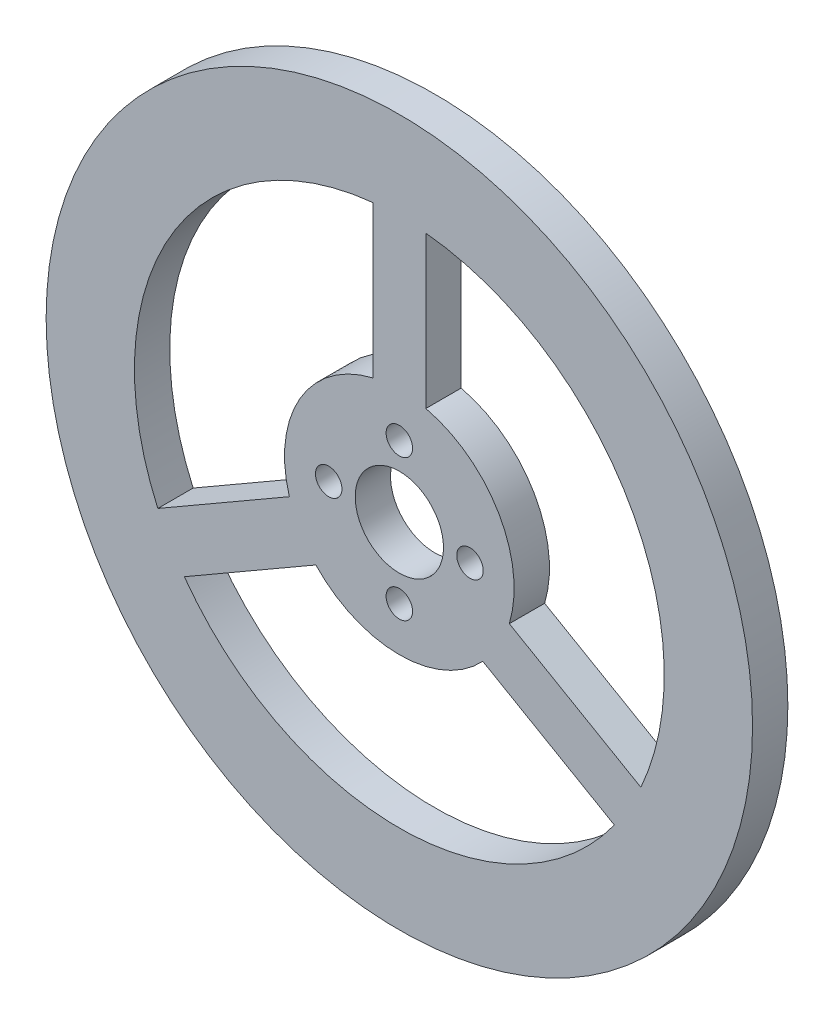
ISO-10303-21;
HEADER;
FILE_DESCRIPTION(('STEP AP214'),'2;1');
FILE_NAME('part.step','',(''),(''),'','','');
FILE_SCHEMA(('AUTOMOTIVE_DESIGN { 1 0 10303 214 1 1 1 1 }'));
ENDSEC;
DATA;
#1=APPLICATION_CONTEXT('core data for automotive mechanical design processes');
#2=APPLICATION_PROTOCOL_DEFINITION('international standard','automotive_design',2000,#1);
#3=PRODUCT_CONTEXT('',#1,'mechanical');
#4=PRODUCT('Part','Part','',(#3));
#5=PRODUCT_RELATED_PRODUCT_CATEGORY('part','',(#4));
#6=PRODUCT_DEFINITION_FORMATION('','',#4);
#7=PRODUCT_DEFINITION_CONTEXT('part definition',#1,'design');
#8=PRODUCT_DEFINITION('design','',#6,#7);
#9=PRODUCT_DEFINITION_SHAPE('','',#8);
#10=(LENGTH_UNIT() NAMED_UNIT(*) SI_UNIT(.MILLI.,.METRE.));
#11=(NAMED_UNIT(*) PLANE_ANGLE_UNIT() SI_UNIT($,.RADIAN.));
#12=(NAMED_UNIT(*) SI_UNIT($,.STERADIAN.) SOLID_ANGLE_UNIT());
#13=UNCERTAINTY_MEASURE_WITH_UNIT(LENGTH_MEASURE(1.E-05),#10,'distance_accuracy_value','');
#14=(GEOMETRIC_REPRESENTATION_CONTEXT(3) GLOBAL_UNCERTAINTY_ASSIGNED_CONTEXT((#13)) GLOBAL_UNIT_ASSIGNED_CONTEXT((#10,
#11,#12)) REPRESENTATION_CONTEXT('',''));
#15=CARTESIAN_POINT('',(0.,0.,0.));
#16=DIRECTION('',(0.,0.,1.));
#17=DIRECTION('',(1.,0.,0.));
#18=AXIS2_PLACEMENT_3D('',#15,#16,#17);
#19=CARTESIAN_POINT('',(0.,0.,4.));
#20=DIRECTION('',(0.,0.,-1.));
#21=DIRECTION('',(-1.,0.,0.));
#22=AXIS2_PLACEMENT_3D('',#19,#20,#21);
#23=CYLINDRICAL_SURFACE('',#22,40.);
#24=CARTESIAN_POINT('',(0.,0.,4.));
#25=DIRECTION('',(0.,0.,1.));
#26=DIRECTION('',(1.,0.,0.));
#27=AXIS2_PLACEMENT_3D('',#24,#25,#26);
#28=CIRCLE('',#27,40.);
#29=CARTESIAN_POINT('',(40.,0.,4.));
#30=VERTEX_POINT('',#29);
#31=EDGE_CURVE('E11',#30,#30,#28,.T.);
#32=ORIENTED_EDGE('',*,*,#31,.F.);
#33=EDGE_LOOP('',(#32));
#34=FACE_BOUND('',#33,.T.);
#35=CARTESIAN_POINT('',(0.,0.,0.));
#36=DIRECTION('',(0.,0.,1.));
#37=DIRECTION('',(1.,0.,0.));
#38=AXIS2_PLACEMENT_3D('',#35,#36,#37);
#39=CIRCLE('',#38,40.);
#40=CARTESIAN_POINT('',(40.,0.,0.));
#41=VERTEX_POINT('',#40);
#42=EDGE_CURVE('E46',#41,#41,#39,.T.);
#43=ORIENTED_EDGE('',*,*,#42,.T.);
#44=EDGE_LOOP('',(#43));
#45=FACE_BOUND('',#44,.T.);
#46=ADVANCED_FACE('F43',(#34,#45),#23,.T.);
#47=CARTESIAN_POINT('',(0.,0.,4.));
#48=DIRECTION('',(0.,0.,1.));
#49=DIRECTION('',(1.,0.,0.));
#50=AXIS2_PLACEMENT_3D('',#47,#48,#49);
#51=PLANE('',#50);
#52=CARTESIAN_POINT('',(0.,0.,4.));
#53=DIRECTION('',(0.,0.,1.));
#54=DIRECTION('',(1.,0.,0.));
#55=AXIS2_PLACEMENT_3D('',#52,#53,#54);
#56=CIRCLE('',#55,30.);
#57=CARTESIAN_POINT('',(-3.,29.8496231131986,4.));
#58=VERTEX_POINT('',#57);
#59=CARTESIAN_POINT('',(-27.3505319094207,-12.3267353452469,4.));
#60=VERTEX_POINT('',#59);
#61=EDGE_CURVE('E58',#58,#60,#56,.T.);
#62=ORIENTED_EDGE('',*,*,#61,.F.);
#63=DIRECTION('',(0.,1.,0.));
#64=VECTOR('',#63,1.);
#65=CARTESIAN_POINT('',(-3.,29.8496231131986,4.));
#66=LINE('',#65,#64);
#67=CARTESIAN_POINT('',(-3.00000000000008,12.6491106406738,4.));
#68=VERTEX_POINT('',#67);
#69=EDGE_CURVE('E241',#68,#58,#66,.T.);
#70=ORIENTED_EDGE('',*,*,#69,.F.);
#71=CARTESIAN_POINT('',(0.,0.,4.));
#72=DIRECTION('',(0.,0.,-1.));
#73=DIRECTION('',(1.,0.,0.));
#74=AXIS2_PLACEMENT_3D('',#71,#72,#73);
#75=CIRCLE('',#74,13.0000000000003);
#76=CARTESIAN_POINT('',(-12.4544511501036,-3.72647910898474,4.));
#77=VERTEX_POINT('',#76);
#78=EDGE_CURVE('E261',#77,#68,#75,.T.);
#79=ORIENTED_EDGE('',*,*,#78,.F.);
#80=DIRECTION('',(0.866025403784439,0.5,0.));
#81=VECTOR('',#80,1.);
#82=CARTESIAN_POINT('',(-27.3505319094207,-12.3267353452469,4.));
#83=LINE('',#82,#81);
#84=EDGE_CURVE('E256',#60,#77,#83,.T.);
#85=ORIENTED_EDGE('',*,*,#84,.F.);
#86=EDGE_LOOP('',(#62,#70,#79,#85));
#87=FACE_BOUND('',#86,.T.);
#88=CARTESIAN_POINT('',(-8.,0.,4.));
#89=DIRECTION('',(0.,0.,1.));
#90=DIRECTION('',(1.,0.,0.));
#91=AXIS2_PLACEMENT_3D('',#88,#89,#90);
#92=CIRCLE('',#91,1.5);
#93=CARTESIAN_POINT('',(-6.5,0.,4.));
#94=VERTEX_POINT('',#93);
#95=EDGE_CURVE('E271',#94,#94,#92,.T.);
#96=ORIENTED_EDGE('',*,*,#95,.F.);
#97=EDGE_LOOP('',(#96));
#98=FACE_BOUND('',#97,.T.);
#99=CARTESIAN_POINT('',(0.,8.,4.));
#100=DIRECTION('',(0.,0.,1.));
#101=DIRECTION('',(1.,0.,0.));
#102=AXIS2_PLACEMENT_3D('',#99,#100,#101);
#103=CIRCLE('',#102,1.5);
#104=CARTESIAN_POINT('',(1.50000000000003,8.,4.));
#105=VERTEX_POINT('',#104);
#106=EDGE_CURVE('E291',#105,#105,#103,.T.);
#107=ORIENTED_EDGE('',*,*,#106,.F.);
#108=EDGE_LOOP('',(#107));
#109=FACE_BOUND('',#108,.T.);
#110=CARTESIAN_POINT('',(8.,0.,4.));
#111=DIRECTION('',(0.,0.,1.));
#112=DIRECTION('',(1.,0.,0.));
#113=AXIS2_PLACEMENT_3D('',#110,#111,#112);
#114=CIRCLE('',#113,1.5);
#115=CARTESIAN_POINT('',(9.5,0.,4.));
#116=VERTEX_POINT('',#115);
#117=EDGE_CURVE('E188',#116,#116,#114,.T.);
#118=ORIENTED_EDGE('',*,*,#117,.F.);
#119=EDGE_LOOP('',(#118));
#120=FACE_BOUND('',#119,.T.);
#121=CARTESIAN_POINT('',(0.,0.,4.));
#122=DIRECTION('',(0.,0.,1.));
#123=DIRECTION('',(1.,0.,0.));
#124=AXIS2_PLACEMENT_3D('',#121,#122,#123);
#125=CIRCLE('',#124,30.);
#126=CARTESIAN_POINT('',(-24.3505319094206,-17.5228877679534,4.));
#127=VERTEX_POINT('',#126);
#128=CARTESIAN_POINT('',(24.350531909421,-17.5228877679528,4.));
#129=VERTEX_POINT('',#128);
#130=EDGE_CURVE('E66',#127,#129,#125,.T.);
#131=ORIENTED_EDGE('',*,*,#130,.F.);
#132=DIRECTION('',(-0.866025403784408,-0.500000000000052,0.));
#133=VECTOR('',#132,1.);
#134=CARTESIAN_POINT('',(-24.3505319094206,-17.5228877679534,4.));
#135=LINE('',#134,#133);
#136=CARTESIAN_POINT('',(-9.4544511501034,-8.92263153168999,4.));
#137=VERTEX_POINT('',#136);
#138=EDGE_CURVE('E156',#137,#127,#135,.T.);
#139=ORIENTED_EDGE('',*,*,#138,.F.);
#140=CARTESIAN_POINT('',(0.,0.,4.));
#141=DIRECTION('',(0.,0.,-1.));
#142=DIRECTION('',(1.,0.,0.));
#143=AXIS2_PLACEMENT_3D('',#140,#141,#142);
#144=CIRCLE('',#143,13.);
#145=CARTESIAN_POINT('',(9.45445115010328,-8.92263153169012,4.));
#146=VERTEX_POINT('',#145);
#147=EDGE_CURVE('E160',#146,#137,#144,.T.);
#148=ORIENTED_EDGE('',*,*,#147,.F.);
#149=DIRECTION('',(-0.866025403784434,0.500000000000009,0.));
#150=VECTOR('',#149,1.);
#151=CARTESIAN_POINT('',(24.350531909421,-17.5228877679528,4.));
#152=LINE('',#151,#150);
#153=EDGE_CURVE('E169',#129,#146,#152,.T.);
#154=ORIENTED_EDGE('',*,*,#153,.F.);
#155=EDGE_LOOP('',(#131,#139,#148,#154));
#156=FACE_BOUND('',#155,.T.);
#157=CARTESIAN_POINT('',(0.,0.,4.));
#158=DIRECTION('',(0.,0.,-1.));
#159=DIRECTION('',(1.,0.,0.));
#160=AXIS2_PLACEMENT_3D('',#157,#158,#159);
#161=CIRCLE('',#160,13.);
#162=CARTESIAN_POINT('',(3.,12.6491106406735,4.));
#163=VERTEX_POINT('',#162);
#164=CARTESIAN_POINT('',(12.4544511501033,-3.7264791089835,4.));
#165=VERTEX_POINT('',#164);
#166=EDGE_CURVE('E178',#163,#165,#161,.T.);
#167=ORIENTED_EDGE('',*,*,#166,.F.);
#168=DIRECTION('',(0.,-1.,0.));
#169=VECTOR('',#168,1.);
#170=CARTESIAN_POINT('',(3.,29.8496231131986,4.));
#171=LINE('',#170,#169);
#172=CARTESIAN_POINT('',(3.,29.8496231131986,4.));
#173=VERTEX_POINT('',#172);
#174=EDGE_CURVE('E199',#173,#163,#171,.T.);
#175=ORIENTED_EDGE('',*,*,#174,.F.);
#176=CARTESIAN_POINT('',(0.,0.,4.));
#177=DIRECTION('',(0.,0.,1.));
#178=DIRECTION('',(1.,0.,0.));
#179=AXIS2_PLACEMENT_3D('',#176,#177,#178);
#180=CIRCLE('',#179,30.);
#181=CARTESIAN_POINT('',(27.350531909421,-12.3267353452462,4.));
#182=VERTEX_POINT('',#181);
#183=EDGE_CURVE('E218',#182,#173,#180,.T.);
#184=ORIENTED_EDGE('',*,*,#183,.F.);
#185=DIRECTION('',(0.866025403784434,-0.500000000000008,0.));
#186=VECTOR('',#185,1.);
#187=CARTESIAN_POINT('',(27.350531909421,-12.3267353452462,4.));
#188=LINE('',#187,#186);
#189=EDGE_CURVE('E214',#165,#182,#188,.T.);
#190=ORIENTED_EDGE('',*,*,#189,.F.);
#191=EDGE_LOOP('',(#167,#175,#184,#190));
#192=FACE_BOUND('',#191,.T.);
#193=CARTESIAN_POINT('',(0.,-8.,4.));
#194=DIRECTION('',(0.,0.,1.));
#195=DIRECTION('',(1.,0.,0.));
#196=AXIS2_PLACEMENT_3D('',#193,#194,#195);
#197=CIRCLE('',#196,1.5);
#198=CARTESIAN_POINT('',(1.49999999999992,-8.,4.));
#199=VERTEX_POINT('',#198);
#200=EDGE_CURVE('E189',#199,#199,#197,.T.);
#201=ORIENTED_EDGE('',*,*,#200,.F.);
#202=EDGE_LOOP('',(#201));
#203=FACE_BOUND('',#202,.T.);
#204=CARTESIAN_POINT('',(0.,0.,4.));
#205=DIRECTION('',(0.,0.,1.));
#206=DIRECTION('',(1.,0.,0.));
#207=AXIS2_PLACEMENT_3D('',#204,#205,#206);
#208=CIRCLE('',#207,5.);
#209=CARTESIAN_POINT('',(5.,0.,4.));
#210=VERTEX_POINT('',#209);
#211=EDGE_CURVE('E284',#210,#210,#208,.T.);
#212=ORIENTED_EDGE('',*,*,#211,.F.);
#213=EDGE_LOOP('',(#212));
#214=FACE_BOUND('',#213,.T.);
#215=ORIENTED_EDGE('',*,*,#31,.T.);
#216=EDGE_LOOP('',(#215));
#217=FACE_BOUND('',#216,.T.);
#218=ADVANCED_FACE('F312',(#87,#98,#109,#120,#156,#192,#203,#214,#217),#51,.T.);
#219=CARTESIAN_POINT('',(0.,0.,0.));
#220=DIRECTION('',(0.,0.,1.));
#221=DIRECTION('',(1.,0.,0.));
#222=AXIS2_PLACEMENT_3D('',#219,#220,#221);
#223=PLANE('',#222);
#224=DIRECTION('',(0.,1.,0.));
#225=VECTOR('',#224,1.);
#226=CARTESIAN_POINT('',(-3.,29.8496231131986,0.));
#227=LINE('',#226,#225);
#228=CARTESIAN_POINT('',(-3.00000000000008,12.6491106406738,0.));
#229=VERTEX_POINT('',#228);
#230=CARTESIAN_POINT('',(-3.,29.8496231131986,0.));
#231=VERTEX_POINT('',#230);
#232=EDGE_CURVE('E249',#229,#231,#227,.T.);
#233=ORIENTED_EDGE('',*,*,#232,.T.);
#234=CARTESIAN_POINT('',(0.,0.,0.));
#235=DIRECTION('',(0.,0.,1.));
#236=DIRECTION('',(1.,0.,0.));
#237=AXIS2_PLACEMENT_3D('',#234,#235,#236);
#238=CIRCLE('',#237,30.);
#239=CARTESIAN_POINT('',(-27.3505319094207,-12.3267353452469,0.));
#240=VERTEX_POINT('',#239);
#241=EDGE_CURVE('E236',#231,#240,#238,.T.);
#242=ORIENTED_EDGE('',*,*,#241,.T.);
#243=DIRECTION('',(0.866025403784439,0.5,0.));
#244=VECTOR('',#243,1.);
#245=CARTESIAN_POINT('',(-27.3505319094207,-12.3267353452469,0.));
#246=LINE('',#245,#244);
#247=CARTESIAN_POINT('',(-12.4544511501036,-3.72647910898474,0.));
#248=VERTEX_POINT('',#247);
#249=EDGE_CURVE('E240',#240,#248,#246,.T.);
#250=ORIENTED_EDGE('',*,*,#249,.T.);
#251=CARTESIAN_POINT('',(0.,0.,0.));
#252=DIRECTION('',(0.,0.,-1.));
#253=DIRECTION('',(1.,0.,0.));
#254=AXIS2_PLACEMENT_3D('',#251,#252,#253);
#255=CIRCLE('',#254,13.0000000000003);
#256=EDGE_CURVE('E245',#248,#229,#255,.T.);
#257=ORIENTED_EDGE('',*,*,#256,.T.);
#258=EDGE_LOOP('',(#233,#242,#250,#257));
#259=FACE_BOUND('',#258,.T.);
#260=CARTESIAN_POINT('',(-8.,0.,0.));
#261=DIRECTION('',(0.,0.,1.));
#262=DIRECTION('',(1.,0.,0.));
#263=AXIS2_PLACEMENT_3D('',#260,#261,#262);
#264=CIRCLE('',#263,1.5);
#265=CARTESIAN_POINT('',(-6.5,0.,0.));
#266=VERTEX_POINT('',#265);
#267=EDGE_CURVE('E280',#266,#266,#264,.T.);
#268=ORIENTED_EDGE('',*,*,#267,.T.);
#269=EDGE_LOOP('',(#268));
#270=FACE_BOUND('',#269,.T.);
#271=CARTESIAN_POINT('',(0.,8.,0.));
#272=DIRECTION('',(0.,0.,1.));
#273=DIRECTION('',(1.,0.,0.));
#274=AXIS2_PLACEMENT_3D('',#271,#272,#273);
#275=CIRCLE('',#274,1.5);
#276=CARTESIAN_POINT('',(1.50000000000003,8.,0.));
#277=VERTEX_POINT('',#276);
#278=EDGE_CURVE('E257',#277,#277,#275,.T.);
#279=ORIENTED_EDGE('',*,*,#278,.T.);
#280=EDGE_LOOP('',(#279));
#281=FACE_BOUND('',#280,.T.);
#282=CARTESIAN_POINT('',(8.,0.,0.));
#283=DIRECTION('',(0.,0.,1.));
#284=DIRECTION('',(1.,0.,0.));
#285=AXIS2_PLACEMENT_3D('',#282,#283,#284);
#286=CIRCLE('',#285,1.5);
#287=CARTESIAN_POINT('',(9.5,0.,0.));
#288=VERTEX_POINT('',#287);
#289=EDGE_CURVE('E295',#288,#288,#286,.T.);
#290=ORIENTED_EDGE('',*,*,#289,.T.);
#291=EDGE_LOOP('',(#290));
#292=FACE_BOUND('',#291,.T.);
#293=DIRECTION('',(-0.866025403784408,-0.500000000000052,0.));
#294=VECTOR('',#293,1.);
#295=CARTESIAN_POINT('',(-24.3505319094206,-17.5228877679534,0.));
#296=LINE('',#295,#294);
#297=CARTESIAN_POINT('',(-9.4544511501034,-8.92263153168999,0.));
#298=VERTEX_POINT('',#297);
#299=CARTESIAN_POINT('',(-24.3505319094206,-17.5228877679534,0.));
#300=VERTEX_POINT('',#299);
#301=EDGE_CURVE('E141',#298,#300,#296,.T.);
#302=ORIENTED_EDGE('',*,*,#301,.T.);
#303=CARTESIAN_POINT('',(0.,0.,0.));
#304=DIRECTION('',(0.,0.,1.));
#305=DIRECTION('',(1.,0.,0.));
#306=AXIS2_PLACEMENT_3D('',#303,#304,#305);
#307=CIRCLE('',#306,30.);
#308=CARTESIAN_POINT('',(24.350531909421,-17.5228877679528,0.));
#309=VERTEX_POINT('',#308);
#310=EDGE_CURVE('E134',#300,#309,#307,.T.);
#311=ORIENTED_EDGE('',*,*,#310,.T.);
#312=DIRECTION('',(-0.866025403784434,0.500000000000009,0.));
#313=VECTOR('',#312,1.);
#314=CARTESIAN_POINT('',(24.350531909421,-17.5228877679528,0.));
#315=LINE('',#314,#313);
#316=CARTESIAN_POINT('',(9.45445115010329,-8.92263153169012,0.));
#317=VERTEX_POINT('',#316);
#318=EDGE_CURVE('E145',#309,#317,#315,.T.);
#319=ORIENTED_EDGE('',*,*,#318,.T.);
#320=CARTESIAN_POINT('',(0.,0.,0.));
#321=DIRECTION('',(0.,0.,-1.));
#322=DIRECTION('',(1.,0.,0.));
#323=AXIS2_PLACEMENT_3D('',#320,#321,#322);
#324=CIRCLE('',#323,13.);
#325=EDGE_CURVE('E150',#317,#298,#324,.T.);
#326=ORIENTED_EDGE('',*,*,#325,.T.);
#327=EDGE_LOOP('',(#302,#311,#319,#326));
#328=FACE_BOUND('',#327,.T.);
#329=DIRECTION('',(0.,-1.,0.));
#330=VECTOR('',#329,1.);
#331=CARTESIAN_POINT('',(3.,29.8496231131986,0.));
#332=LINE('',#331,#330);
#333=CARTESIAN_POINT('',(3.,29.8496231131986,0.));
#334=VERTEX_POINT('',#333);
#335=CARTESIAN_POINT('',(3.,12.6491106406735,0.));
#336=VERTEX_POINT('',#335);
#337=EDGE_CURVE('E207',#334,#336,#332,.T.);
#338=ORIENTED_EDGE('',*,*,#337,.T.);
#339=CARTESIAN_POINT('',(0.,0.,0.));
#340=DIRECTION('',(0.,0.,-1.));
#341=DIRECTION('',(1.,0.,0.));
#342=AXIS2_PLACEMENT_3D('',#339,#340,#341);
#343=CIRCLE('',#342,13.);
#344=CARTESIAN_POINT('',(12.4544511501033,-3.7264791089835,0.));
#345=VERTEX_POINT('',#344);
#346=EDGE_CURVE('E194',#336,#345,#343,.T.);
#347=ORIENTED_EDGE('',*,*,#346,.T.);
#348=DIRECTION('',(0.866025403784434,-0.500000000000008,0.));
#349=VECTOR('',#348,1.);
#350=CARTESIAN_POINT('',(27.350531909421,-12.3267353452462,0.));
#351=LINE('',#350,#349);
#352=CARTESIAN_POINT('',(27.350531909421,-12.3267353452462,0.));
#353=VERTEX_POINT('',#352);
#354=EDGE_CURVE('E198',#345,#353,#351,.T.);
#355=ORIENTED_EDGE('',*,*,#354,.T.);
#356=CARTESIAN_POINT('',(0.,0.,0.));
#357=DIRECTION('',(0.,0.,1.));
#358=DIRECTION('',(1.,0.,0.));
#359=AXIS2_PLACEMENT_3D('',#356,#357,#358);
#360=CIRCLE('',#359,30.);
#361=EDGE_CURVE('E203',#353,#334,#360,.T.);
#362=ORIENTED_EDGE('',*,*,#361,.T.);
#363=EDGE_LOOP('',(#338,#347,#355,#362));
#364=FACE_BOUND('',#363,.T.);
#365=CARTESIAN_POINT('',(0.,-8.,0.));
#366=DIRECTION('',(0.,0.,1.));
#367=DIRECTION('',(1.,0.,0.));
#368=AXIS2_PLACEMENT_3D('',#365,#366,#367);
#369=CIRCLE('',#368,1.5);
#370=CARTESIAN_POINT('',(1.49999999999992,-8.,0.));
#371=VERTEX_POINT('',#370);
#372=EDGE_CURVE('E184',#371,#371,#369,.T.);
#373=ORIENTED_EDGE('',*,*,#372,.T.);
#374=EDGE_LOOP('',(#373));
#375=FACE_BOUND('',#374,.T.);
#376=CARTESIAN_POINT('',(0.,0.,0.));
#377=DIRECTION('',(0.,0.,1.));
#378=DIRECTION('',(1.,0.,0.));
#379=AXIS2_PLACEMENT_3D('',#376,#377,#378);
#380=CIRCLE('',#379,5.);
#381=CARTESIAN_POINT('',(5.,0.,0.));
#382=VERTEX_POINT('',#381);
#383=EDGE_CURVE('E302',#382,#382,#380,.T.);
#384=ORIENTED_EDGE('',*,*,#383,.T.);
#385=EDGE_LOOP('',(#384));
#386=FACE_BOUND('',#385,.T.);
#387=ORIENTED_EDGE('',*,*,#42,.F.);
#388=EDGE_LOOP('',(#387));
#389=FACE_BOUND('',#388,.T.);
#390=ADVANCED_FACE('F152',(#259,#270,#281,#292,#328,#364,#375,#386,#389),#223,.F.);
#391=CARTESIAN_POINT('',(0.,0.,0.));
#392=DIRECTION('',(0.,0.,1.));
#393=DIRECTION('',(1.,0.,0.));
#394=AXIS2_PLACEMENT_3D('',#391,#392,#393);
#395=CYLINDRICAL_SURFACE('',#394,5.);
#396=ORIENTED_EDGE('',*,*,#383,.F.);
#397=EDGE_LOOP('',(#396));
#398=FACE_BOUND('',#397,.T.);
#399=ORIENTED_EDGE('',*,*,#211,.T.);
#400=EDGE_LOOP('',(#399));
#401=FACE_BOUND('',#400,.T.);
#402=ADVANCED_FACE('F310',(#398,#401),#395,.F.);
#403=CARTESIAN_POINT('',(0.,-8.,0.));
#404=DIRECTION('',(0.,0.,1.));
#405=DIRECTION('',(1.,0.,0.));
#406=AXIS2_PLACEMENT_3D('',#403,#404,#405);
#407=CYLINDRICAL_SURFACE('',#406,1.5);
#408=ORIENTED_EDGE('',*,*,#372,.F.);
#409=EDGE_LOOP('',(#408));
#410=FACE_BOUND('',#409,.T.);
#411=ORIENTED_EDGE('',*,*,#200,.T.);
#412=EDGE_LOOP('',(#411));
#413=FACE_BOUND('',#412,.T.);
#414=ADVANCED_FACE('F330',(#410,#413),#407,.F.);
#415=CARTESIAN_POINT('',(0.,0.,0.));
#416=DIRECTION('',(0.,0.,1.));
#417=DIRECTION('',(1.,0.,0.));
#418=AXIS2_PLACEMENT_3D('',#415,#416,#417);
#419=CYLINDRICAL_SURFACE('',#418,13.);
#420=ORIENTED_EDGE('',*,*,#166,.T.);
#421=DIRECTION('',(0.,0.,1.));
#422=VECTOR('',#421,1.);
#423=CARTESIAN_POINT('',(12.4544511501033,-3.7264791089835,0.));
#424=LINE('',#423,#422);
#425=EDGE_CURVE('E211',#345,#165,#424,.T.);
#426=ORIENTED_EDGE('',*,*,#425,.F.);
#427=ORIENTED_EDGE('',*,*,#346,.F.);
#428=DIRECTION('',(0.,0.,1.));
#429=VECTOR('',#428,1.);
#430=CARTESIAN_POINT('',(3.,12.6491106406735,0.));
#431=LINE('',#430,#429);
#432=EDGE_CURVE('E193',#336,#163,#431,.T.);
#433=ORIENTED_EDGE('',*,*,#432,.T.);
#434=EDGE_LOOP('',(#420,#426,#427,#433));
#435=FACE_BOUND('',#434,.T.);
#436=ADVANCED_FACE('F362',(#435),#419,.T.);
#437=CARTESIAN_POINT('',(3.,29.8496231131986,0.));
#438=DIRECTION('',(-1.,0.,0.));
#439=DIRECTION('',(0.,0.,1.));
#440=AXIS2_PLACEMENT_3D('',#437,#438,#439);
#441=PLANE('',#440);
#442=ORIENTED_EDGE('',*,*,#174,.T.);
#443=ORIENTED_EDGE('',*,*,#432,.F.);
#444=ORIENTED_EDGE('',*,*,#337,.F.);
#445=DIRECTION('',(0.,0.,1.));
#446=VECTOR('',#445,1.);
#447=CARTESIAN_POINT('',(3.,29.8496231131986,0.));
#448=LINE('',#447,#446);
#449=EDGE_CURVE('E227',#334,#173,#448,.T.);
#450=ORIENTED_EDGE('',*,*,#449,.T.);
#451=EDGE_LOOP('',(#442,#443,#444,#450));
#452=FACE_BOUND('',#451,.T.);
#453=ADVANCED_FACE('F365',(#452),#441,.F.);
#454=CARTESIAN_POINT('',(0.,0.,0.));
#455=DIRECTION('',(0.,0.,1.));
#456=DIRECTION('',(1.,0.,0.));
#457=AXIS2_PLACEMENT_3D('',#454,#455,#456);
#458=CYLINDRICAL_SURFACE('',#457,30.);
#459=ORIENTED_EDGE('',*,*,#183,.T.);
#460=ORIENTED_EDGE('',*,*,#449,.F.);
#461=ORIENTED_EDGE('',*,*,#361,.F.);
#462=DIRECTION('',(0.,0.,1.));
#463=VECTOR('',#462,1.);
#464=CARTESIAN_POINT('',(27.350531909421,-12.3267353452462,0.));
#465=LINE('',#464,#463);
#466=EDGE_CURVE('E230',#353,#182,#465,.T.);
#467=ORIENTED_EDGE('',*,*,#466,.T.);
#468=EDGE_LOOP('',(#459,#460,#461,#467));
#469=FACE_BOUND('',#468,.T.);
#470=ADVANCED_FACE('F370',(#469),#458,.F.);
#471=CARTESIAN_POINT('',(27.350531909421,-12.3267353452462,0.));
#472=DIRECTION('',(-0.500000000000008,-0.866025403784434,0.));
#473=DIRECTION('',(0.866025403784434,-0.500000000000009,0.));
#474=AXIS2_PLACEMENT_3D('',#471,#472,#473);
#475=PLANE('',#474);
#476=ORIENTED_EDGE('',*,*,#189,.T.);
#477=ORIENTED_EDGE('',*,*,#466,.F.);
#478=ORIENTED_EDGE('',*,*,#354,.F.);
#479=ORIENTED_EDGE('',*,*,#425,.T.);
#480=EDGE_LOOP('',(#476,#477,#478,#479));
#481=FACE_BOUND('',#480,.T.);
#482=ADVANCED_FACE('F367',(#481),#475,.F.);
#483=CARTESIAN_POINT('',(0.,0.,0.));
#484=DIRECTION('',(0.,0.,1.));
#485=DIRECTION('',(1.,0.,0.));
#486=AXIS2_PLACEMENT_3D('',#483,#484,#485);
#487=CYLINDRICAL_SURFACE('',#486,30.);
#488=ORIENTED_EDGE('',*,*,#130,.T.);
#489=DIRECTION('',(0.,0.,1.));
#490=VECTOR('',#489,1.);
#491=CARTESIAN_POINT('',(24.350531909421,-17.5228877679528,0.));
#492=LINE('',#491,#490);
#493=EDGE_CURVE('E130',#309,#129,#492,.T.);
#494=ORIENTED_EDGE('',*,*,#493,.F.);
#495=ORIENTED_EDGE('',*,*,#310,.F.);
#496=DIRECTION('',(0.,0.,1.));
#497=VECTOR('',#496,1.);
#498=CARTESIAN_POINT('',(-24.3505319094206,-17.5228877679534,0.));
#499=LINE('',#498,#497);
#500=EDGE_CURVE('E175',#300,#127,#499,.T.);
#501=ORIENTED_EDGE('',*,*,#500,.T.);
#502=EDGE_LOOP('',(#488,#494,#495,#501));
#503=FACE_BOUND('',#502,.T.);
#504=ADVANCED_FACE('F132',(#503),#487,.F.);
#505=CARTESIAN_POINT('',(-24.3505319094206,-17.5228877679534,0.));
#506=DIRECTION('',(-0.500000000000052,0.866025403784408,0.));
#507=DIRECTION('',(-0.866025403784408,-0.500000000000052,0.));
#508=AXIS2_PLACEMENT_3D('',#505,#506,#507);
#509=PLANE('',#508);
#510=ORIENTED_EDGE('',*,*,#138,.T.);
#511=ORIENTED_EDGE('',*,*,#500,.F.);
#512=ORIENTED_EDGE('',*,*,#301,.F.);
#513=DIRECTION('',(0.,0.,1.));
#514=VECTOR('',#513,1.);
#515=CARTESIAN_POINT('',(-9.4544511501034,-8.92263153168999,0.));
#516=LINE('',#515,#514);
#517=EDGE_CURVE('E179',#298,#137,#516,.T.);
#518=ORIENTED_EDGE('',*,*,#517,.T.);
#519=EDGE_LOOP('',(#510,#511,#512,#518));
#520=FACE_BOUND('',#519,.T.);
#521=ADVANCED_FACE('F383',(#520),#509,.F.);
#522=CARTESIAN_POINT('',(0.,0.,0.));
#523=DIRECTION('',(0.,0.,1.));
#524=DIRECTION('',(1.,0.,0.));
#525=AXIS2_PLACEMENT_3D('',#522,#523,#524);
#526=CYLINDRICAL_SURFACE('',#525,13.);
#527=ORIENTED_EDGE('',*,*,#147,.T.);
#528=ORIENTED_EDGE('',*,*,#517,.F.);
#529=ORIENTED_EDGE('',*,*,#325,.F.);
#530=DIRECTION('',(0.,0.,1.));
#531=VECTOR('',#530,1.);
#532=CARTESIAN_POINT('',(9.45445115010328,-8.92263153169012,0.));
#533=LINE('',#532,#531);
#534=EDGE_CURVE('E140',#317,#146,#533,.T.);
#535=ORIENTED_EDGE('',*,*,#534,.T.);
#536=EDGE_LOOP('',(#527,#528,#529,#535));
#537=FACE_BOUND('',#536,.T.);
#538=ADVANCED_FACE('F386',(#537),#526,.T.);
#539=CARTESIAN_POINT('',(24.350531909421,-17.5228877679528,0.));
#540=DIRECTION('',(0.500000000000009,0.866025403784434,0.));
#541=DIRECTION('',(-0.866025403784434,0.500000000000009,0.));
#542=AXIS2_PLACEMENT_3D('',#539,#540,#541);
#543=PLANE('',#542);
#544=ORIENTED_EDGE('',*,*,#153,.T.);
#545=ORIENTED_EDGE('',*,*,#534,.F.);
#546=ORIENTED_EDGE('',*,*,#318,.F.);
#547=ORIENTED_EDGE('',*,*,#493,.T.);
#548=EDGE_LOOP('',(#544,#545,#546,#547));
#549=FACE_BOUND('',#548,.T.);
#550=ADVANCED_FACE('F146',(#549),#543,.F.);
#551=CARTESIAN_POINT('',(8.,0.,0.));
#552=DIRECTION('',(0.,0.,1.));
#553=DIRECTION('',(1.,0.,0.));
#554=AXIS2_PLACEMENT_3D('',#551,#552,#553);
#555=CYLINDRICAL_SURFACE('',#554,1.5);
#556=ORIENTED_EDGE('',*,*,#289,.F.);
#557=EDGE_LOOP('',(#556));
#558=FACE_BOUND('',#557,.T.);
#559=ORIENTED_EDGE('',*,*,#117,.T.);
#560=EDGE_LOOP('',(#559));
#561=FACE_BOUND('',#560,.T.);
#562=ADVANCED_FACE('F335',(#558,#561),#555,.F.);
#563=CARTESIAN_POINT('',(0.,8.,0.));
#564=DIRECTION('',(0.,0.,1.));
#565=DIRECTION('',(1.,0.,0.));
#566=AXIS2_PLACEMENT_3D('',#563,#564,#565);
#567=CYLINDRICAL_SURFACE('',#566,1.5);
#568=ORIENTED_EDGE('',*,*,#278,.F.);
#569=EDGE_LOOP('',(#568));
#570=FACE_BOUND('',#569,.T.);
#571=ORIENTED_EDGE('',*,*,#106,.T.);
#572=EDGE_LOOP('',(#571));
#573=FACE_BOUND('',#572,.T.);
#574=ADVANCED_FACE('F338',(#570,#573),#567,.F.);
#575=CARTESIAN_POINT('',(-8.,0.,0.));
#576=DIRECTION('',(0.,0.,1.));
#577=DIRECTION('',(1.,0.,0.));
#578=AXIS2_PLACEMENT_3D('',#575,#576,#577);
#579=CYLINDRICAL_SURFACE('',#578,1.5);
#580=ORIENTED_EDGE('',*,*,#267,.F.);
#581=EDGE_LOOP('',(#580));
#582=FACE_BOUND('',#581,.T.);
#583=ORIENTED_EDGE('',*,*,#95,.T.);
#584=EDGE_LOOP('',(#583));
#585=FACE_BOUND('',#584,.T.);
#586=ADVANCED_FACE('F342',(#582,#585),#579,.F.);
#587=CARTESIAN_POINT('',(0.,0.,0.));
#588=DIRECTION('',(0.,0.,1.));
#589=DIRECTION('',(1.,0.,0.));
#590=AXIS2_PLACEMENT_3D('',#587,#588,#589);
#591=CYLINDRICAL_SURFACE('',#590,30.);
#592=ORIENTED_EDGE('',*,*,#61,.T.);
#593=DIRECTION('',(0.,0.,1.));
#594=VECTOR('',#593,1.);
#595=CARTESIAN_POINT('',(-27.3505319094207,-12.3267353452469,0.));
#596=LINE('',#595,#594);
#597=EDGE_CURVE('E253',#240,#60,#596,.T.);
#598=ORIENTED_EDGE('',*,*,#597,.F.);
#599=ORIENTED_EDGE('',*,*,#241,.F.);
#600=DIRECTION('',(0.,0.,1.));
#601=VECTOR('',#600,1.);
#602=CARTESIAN_POINT('',(-3.,29.8496231131986,0.));
#603=LINE('',#602,#601);
#604=EDGE_CURVE('E268',#231,#58,#603,.T.);
#605=ORIENTED_EDGE('',*,*,#604,.T.);
#606=EDGE_LOOP('',(#592,#598,#599,#605));
#607=FACE_BOUND('',#606,.T.);
#608=ADVANCED_FACE('F346',(#607),#591,.F.);
#609=CARTESIAN_POINT('',(-3.,29.8496231131986,0.));
#610=DIRECTION('',(1.,0.,0.));
#611=DIRECTION('',(0.,0.,-1.));
#612=AXIS2_PLACEMENT_3D('',#609,#610,#611);
#613=PLANE('',#612);
#614=ORIENTED_EDGE('',*,*,#69,.T.);
#615=ORIENTED_EDGE('',*,*,#604,.F.);
#616=ORIENTED_EDGE('',*,*,#232,.F.);
#617=DIRECTION('',(0.,0.,1.));
#618=VECTOR('',#617,1.);
#619=CARTESIAN_POINT('',(-3.00000000000008,12.6491106406738,0.));
#620=LINE('',#619,#618);
#621=EDGE_CURVE('E272',#229,#68,#620,.T.);
#622=ORIENTED_EDGE('',*,*,#621,.T.);
#623=EDGE_LOOP('',(#614,#615,#616,#622));
#624=FACE_BOUND('',#623,.T.);
#625=ADVANCED_FACE('F350',(#624),#613,.F.);
#626=CARTESIAN_POINT('',(0.,0.,0.));
#627=DIRECTION('',(0.,0.,1.));
#628=DIRECTION('',(1.,0.,0.));
#629=AXIS2_PLACEMENT_3D('',#626,#627,#628);
#630=CYLINDRICAL_SURFACE('',#629,13.0000000000003);
#631=ORIENTED_EDGE('',*,*,#78,.T.);
#632=ORIENTED_EDGE('',*,*,#621,.F.);
#633=ORIENTED_EDGE('',*,*,#256,.F.);
#634=DIRECTION('',(0.,0.,1.));
#635=VECTOR('',#634,1.);
#636=CARTESIAN_POINT('',(-12.4544511501036,-3.72647910898474,0.));
#637=LINE('',#636,#635);
#638=EDGE_CURVE('E275',#248,#77,#637,.T.);
#639=ORIENTED_EDGE('',*,*,#638,.T.);
#640=EDGE_LOOP('',(#631,#632,#633,#639));
#641=FACE_BOUND('',#640,.T.);
#642=ADVANCED_FACE('F354',(#641),#630,.T.);
#643=CARTESIAN_POINT('',(-27.3505319094207,-12.3267353452469,0.));
#644=DIRECTION('',(0.5,-0.866025403784439,0.));
#645=DIRECTION('',(0.866025403784439,0.5,0.));
#646=AXIS2_PLACEMENT_3D('',#643,#644,#645);
#647=PLANE('',#646);
#648=ORIENTED_EDGE('',*,*,#84,.T.);
#649=ORIENTED_EDGE('',*,*,#638,.F.);
#650=ORIENTED_EDGE('',*,*,#249,.F.);
#651=ORIENTED_EDGE('',*,*,#597,.T.);
#652=EDGE_LOOP('',(#648,#649,#650,#651));
#653=FACE_BOUND('',#652,.T.);
#654=ADVANCED_FACE('F351',(#653),#647,.F.);
#655=CLOSED_SHELL('',(#46,#218,#390,#402,#414,#436,#453,#470,#482,#504,#521,#538,#550,#562,#574,
#586,#608,#625,#642,#654));
#656=MANIFOLD_SOLID_BREP('B2',#655);
#657=ADVANCED_BREP_SHAPE_REPRESENTATION('',(#18,#656),#14);
#658=SHAPE_DEFINITION_REPRESENTATION(#9,#657);
ENDSEC;
END-ISO-10303-21;
